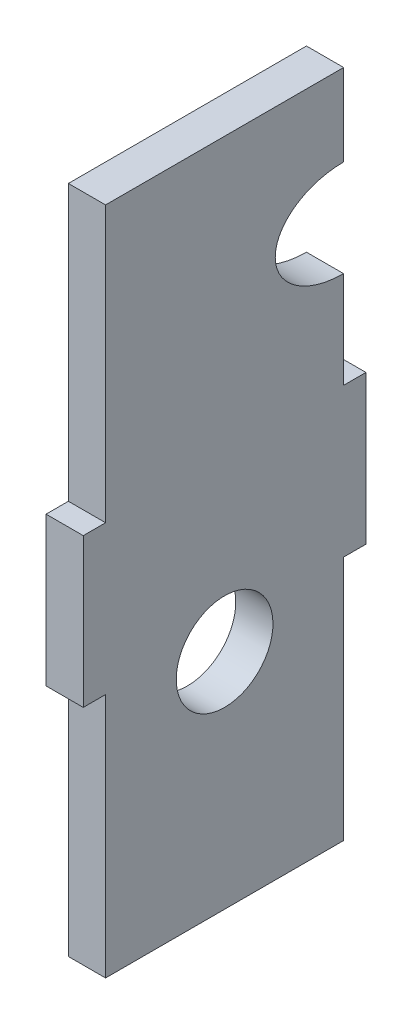
ISO-10303-21;
HEADER;
FILE_DESCRIPTION(('STEP AP214'),'2;1');
FILE_NAME('part.step','',(''),(''),'','','');
FILE_SCHEMA(('AUTOMOTIVE_DESIGN { 1 0 10303 214 1 1 1 1 }'));
ENDSEC;
DATA;
#1=APPLICATION_CONTEXT('core data for automotive mechanical design processes');
#2=APPLICATION_PROTOCOL_DEFINITION('international standard','automotive_design',2000,#1);
#3=PRODUCT_CONTEXT('',#1,'mechanical');
#4=PRODUCT('Part','Part','',(#3));
#5=PRODUCT_RELATED_PRODUCT_CATEGORY('part','',(#4));
#6=PRODUCT_DEFINITION_FORMATION('','',#4);
#7=PRODUCT_DEFINITION_CONTEXT('part definition',#1,'design');
#8=PRODUCT_DEFINITION('design','',#6,#7);
#9=PRODUCT_DEFINITION_SHAPE('','',#8);
#10=(LENGTH_UNIT() NAMED_UNIT(*) SI_UNIT(.MILLI.,.METRE.));
#11=(NAMED_UNIT(*) PLANE_ANGLE_UNIT() SI_UNIT($,.RADIAN.));
#12=(NAMED_UNIT(*) SI_UNIT($,.STERADIAN.) SOLID_ANGLE_UNIT());
#13=UNCERTAINTY_MEASURE_WITH_UNIT(LENGTH_MEASURE(1.E-05),#10,'distance_accuracy_value','');
#14=(GEOMETRIC_REPRESENTATION_CONTEXT(3) GLOBAL_UNCERTAINTY_ASSIGNED_CONTEXT((#13)) GLOBAL_UNIT_ASSIGNED_CONTEXT((#10,
#11,#12)) REPRESENTATION_CONTEXT('',''));
#15=CARTESIAN_POINT('',(0.,0.,0.));
#16=DIRECTION('',(0.,0.,1.));
#17=DIRECTION('',(1.,0.,0.));
#18=AXIS2_PLACEMENT_3D('',#15,#16,#17);
#19=CARTESIAN_POINT('',(36.,-32.5,3.99999999999999));
#20=DIRECTION('',(0.,0.,1.));
#21=DIRECTION('',(0.,1.,0.));
#22=AXIS2_PLACEMENT_3D('',#19,#20,#21);
#23=PLANE('',#22);
#24=DIRECTION('',(-1.,0.,0.));
#25=VECTOR('',#24,1.);
#26=CARTESIAN_POINT('',(36.,-19.5,4.));
#27=LINE('',#26,#25);
#28=CARTESIAN_POINT('',(41.,-19.5,4.));
#29=VERTEX_POINT('',#28);
#30=CARTESIAN_POINT('',(36.,-19.5,4.));
#31=VERTEX_POINT('',#30);
#32=EDGE_CURVE('E11',#29,#31,#27,.T.);
#33=ORIENTED_EDGE('',*,*,#32,.F.);
#34=DIRECTION('',(0.,-1.,0.));
#35=VECTOR('',#34,1.);
#36=CARTESIAN_POINT('',(41.,0.,3.99999999999999));
#37=LINE('',#36,#35);
#38=CARTESIAN_POINT('',(41.,-32.5,3.99999999999999));
#39=VERTEX_POINT('',#38);
#40=EDGE_CURVE('E129',#39,#29,#37,.F.);
#41=ORIENTED_EDGE('',*,*,#40,.F.);
#42=DIRECTION('',(-1.,0.,0.));
#43=VECTOR('',#42,1.);
#44=CARTESIAN_POINT('',(36.,-32.5,3.99999999999999));
#45=LINE('',#44,#43);
#46=CARTESIAN_POINT('',(36.,-32.5,3.99999999999999));
#47=VERTEX_POINT('',#46);
#48=EDGE_CURVE('E54',#39,#47,#45,.T.);
#49=ORIENTED_EDGE('',*,*,#48,.T.);
#50=DIRECTION('',(0.,1.,0.));
#51=VECTOR('',#50,1.);
#52=CARTESIAN_POINT('',(36.,-32.5,3.99999999999999));
#53=LINE('',#52,#51);
#54=EDGE_CURVE('E221',#47,#31,#53,.T.);
#55=ORIENTED_EDGE('',*,*,#54,.T.);
#56=EDGE_LOOP('',(#33,#41,#49,#55));
#57=FACE_BOUND('',#56,.T.);
#58=ADVANCED_FACE('F43',(#57),#23,.F.);
#59=CARTESIAN_POINT('',(36.,-32.5,0.99999999999999));
#60=DIRECTION('',(0.,-1.,0.));
#61=DIRECTION('',(0.,0.,1.));
#62=AXIS2_PLACEMENT_3D('',#59,#60,#61);
#63=PLANE('',#62);
#64=ORIENTED_EDGE('',*,*,#48,.F.);
#65=DIRECTION('',(0.,0.,1.));
#66=VECTOR('',#65,1.);
#67=CARTESIAN_POINT('',(41.,-32.5,0.));
#68=LINE('',#67,#66);
#69=CARTESIAN_POINT('',(41.,-32.5,0.99999999999999));
#70=VERTEX_POINT('',#69);
#71=EDGE_CURVE('E182',#70,#39,#68,.T.);
#72=ORIENTED_EDGE('',*,*,#71,.F.);
#73=DIRECTION('',(-1.,0.,0.));
#74=VECTOR('',#73,1.);
#75=CARTESIAN_POINT('',(36.,-32.5,0.99999999999999));
#76=LINE('',#75,#74);
#77=CARTESIAN_POINT('',(36.,-32.5,0.99999999999999));
#78=VERTEX_POINT('',#77);
#79=EDGE_CURVE('E214',#70,#78,#76,.T.);
#80=ORIENTED_EDGE('',*,*,#79,.T.);
#81=DIRECTION('',(0.,0.,1.));
#82=VECTOR('',#81,1.);
#83=CARTESIAN_POINT('',(36.,-32.5,0.99999999999999));
#84=LINE('',#83,#82);
#85=EDGE_CURVE('E231',#78,#47,#84,.T.);
#86=ORIENTED_EDGE('',*,*,#85,.T.);
#87=EDGE_LOOP('',(#64,#72,#80,#86));
#88=FACE_BOUND('',#87,.T.);
#89=ADVANCED_FACE('F236',(#88),#63,.F.);
#90=CARTESIAN_POINT('',(36.,-52.5,0.99999999999999));
#91=DIRECTION('',(0.,0.,1.));
#92=DIRECTION('',(0.,1.,0.));
#93=AXIS2_PLACEMENT_3D('',#90,#91,#92);
#94=PLANE('',#93);
#95=ORIENTED_EDGE('',*,*,#79,.F.);
#96=DIRECTION('',(0.,-1.,0.));
#97=VECTOR('',#96,1.);
#98=CARTESIAN_POINT('',(41.,0.,0.99999999999999));
#99=LINE('',#98,#97);
#100=CARTESIAN_POINT('',(41.,-52.5,0.99999999999999));
#101=VERTEX_POINT('',#100);
#102=EDGE_CURVE('E178',#101,#70,#99,.F.);
#103=ORIENTED_EDGE('',*,*,#102,.F.);
#104=DIRECTION('',(-1.,0.,0.));
#105=VECTOR('',#104,1.);
#106=CARTESIAN_POINT('',(36.,-52.5,0.99999999999999));
#107=LINE('',#106,#105);
#108=CARTESIAN_POINT('',(36.,-52.5,0.99999999999999));
#109=VERTEX_POINT('',#108);
#110=EDGE_CURVE('E211',#101,#109,#107,.T.);
#111=ORIENTED_EDGE('',*,*,#110,.T.);
#112=DIRECTION('',(0.,1.,0.));
#113=VECTOR('',#112,1.);
#114=CARTESIAN_POINT('',(36.,-52.5,0.99999999999999));
#115=LINE('',#114,#113);
#116=EDGE_CURVE('E238',#109,#78,#115,.T.);
#117=ORIENTED_EDGE('',*,*,#116,.T.);
#118=EDGE_LOOP('',(#95,#103,#111,#117));
#119=FACE_BOUND('',#118,.T.);
#120=ADVANCED_FACE('F307',(#119),#94,.F.);
#121=CARTESIAN_POINT('',(36.,-52.5,4.));
#122=DIRECTION('',(0.,1.,0.));
#123=DIRECTION('',(0.,0.,-1.));
#124=AXIS2_PLACEMENT_3D('',#121,#122,#123);
#125=PLANE('',#124);
#126=ORIENTED_EDGE('',*,*,#110,.F.);
#127=DIRECTION('',(0.,0.,1.));
#128=VECTOR('',#127,1.);
#129=CARTESIAN_POINT('',(41.,-52.5,0.));
#130=LINE('',#129,#128);
#131=CARTESIAN_POINT('',(41.,-52.5,4.));
#132=VERTEX_POINT('',#131);
#133=EDGE_CURVE('E174',#132,#101,#130,.F.);
#134=ORIENTED_EDGE('',*,*,#133,.F.);
#135=DIRECTION('',(-1.,0.,0.));
#136=VECTOR('',#135,1.);
#137=CARTESIAN_POINT('',(36.,-52.5,4.));
#138=LINE('',#137,#136);
#139=CARTESIAN_POINT('',(36.,-52.5,4.));
#140=VERTEX_POINT('',#139);
#141=EDGE_CURVE('E208',#132,#140,#138,.T.);
#142=ORIENTED_EDGE('',*,*,#141,.T.);
#143=DIRECTION('',(0.,0.,-1.));
#144=VECTOR('',#143,1.);
#145=CARTESIAN_POINT('',(36.,-52.5,4.));
#146=LINE('',#145,#144);
#147=EDGE_CURVE('E242',#140,#109,#146,.T.);
#148=ORIENTED_EDGE('',*,*,#147,.T.);
#149=EDGE_LOOP('',(#126,#134,#142,#148));
#150=FACE_BOUND('',#149,.T.);
#151=ADVANCED_FACE('F312',(#150),#125,.F.);
#152=CARTESIAN_POINT('',(36.,-85.5,4.));
#153=DIRECTION('',(0.,0.,1.));
#154=DIRECTION('',(0.,1.,0.));
#155=AXIS2_PLACEMENT_3D('',#152,#153,#154);
#156=PLANE('',#155);
#157=ORIENTED_EDGE('',*,*,#141,.F.);
#158=DIRECTION('',(0.,-1.,0.));
#159=VECTOR('',#158,1.);
#160=CARTESIAN_POINT('',(41.,0.,4.));
#161=LINE('',#160,#159);
#162=CARTESIAN_POINT('',(41.,-85.5,4.));
#163=VERTEX_POINT('',#162);
#164=EDGE_CURVE('E170',#163,#132,#161,.F.);
#165=ORIENTED_EDGE('',*,*,#164,.F.);
#166=DIRECTION('',(-1.,0.,0.));
#167=VECTOR('',#166,1.);
#168=CARTESIAN_POINT('',(36.,-85.5,4.));
#169=LINE('',#168,#167);
#170=CARTESIAN_POINT('',(36.,-85.5,4.));
#171=VERTEX_POINT('',#170);
#172=EDGE_CURVE('E205',#163,#171,#169,.T.);
#173=ORIENTED_EDGE('',*,*,#172,.T.);
#174=DIRECTION('',(0.,1.,0.));
#175=VECTOR('',#174,1.);
#176=CARTESIAN_POINT('',(36.,-85.5,4.));
#177=LINE('',#176,#175);
#178=EDGE_CURVE('E249',#171,#140,#177,.T.);
#179=ORIENTED_EDGE('',*,*,#178,.T.);
#180=EDGE_LOOP('',(#157,#165,#173,#179));
#181=FACE_BOUND('',#180,.T.);
#182=ADVANCED_FACE('F315',(#181),#156,.F.);
#183=CARTESIAN_POINT('',(36.,-85.5,36.));
#184=DIRECTION('',(0.,1.,0.));
#185=DIRECTION('',(0.,0.,-1.));
#186=AXIS2_PLACEMENT_3D('',#183,#184,#185);
#187=PLANE('',#186);
#188=ORIENTED_EDGE('',*,*,#172,.F.);
#189=DIRECTION('',(0.,0.,1.));
#190=VECTOR('',#189,1.);
#191=CARTESIAN_POINT('',(41.,-85.5,0.));
#192=LINE('',#191,#190);
#193=CARTESIAN_POINT('',(41.,-85.5,36.));
#194=VERTEX_POINT('',#193);
#195=EDGE_CURVE('E166',#194,#163,#192,.F.);
#196=ORIENTED_EDGE('',*,*,#195,.F.);
#197=DIRECTION('',(-1.,0.,0.));
#198=VECTOR('',#197,1.);
#199=CARTESIAN_POINT('',(36.,-85.5,36.));
#200=LINE('',#199,#198);
#201=CARTESIAN_POINT('',(36.,-85.5,36.));
#202=VERTEX_POINT('',#201);
#203=EDGE_CURVE('E202',#194,#202,#200,.T.);
#204=ORIENTED_EDGE('',*,*,#203,.T.);
#205=DIRECTION('',(0.,0.,-1.));
#206=VECTOR('',#205,1.);
#207=CARTESIAN_POINT('',(36.,-85.5,36.));
#208=LINE('',#207,#206);
#209=EDGE_CURVE('E253',#202,#171,#208,.T.);
#210=ORIENTED_EDGE('',*,*,#209,.T.);
#211=EDGE_LOOP('',(#188,#196,#204,#210));
#212=FACE_BOUND('',#211,.T.);
#213=ADVANCED_FACE('F319',(#212),#187,.F.);
#214=CARTESIAN_POINT('',(36.,-52.5,36.));
#215=DIRECTION('',(0.,0.,-1.));
#216=DIRECTION('',(0.,-1.,0.));
#217=AXIS2_PLACEMENT_3D('',#214,#215,#216);
#218=PLANE('',#217);
#219=ORIENTED_EDGE('',*,*,#203,.F.);
#220=DIRECTION('',(0.,-1.,0.));
#221=VECTOR('',#220,1.);
#222=CARTESIAN_POINT('',(41.,0.,36.));
#223=LINE('',#222,#221);
#224=CARTESIAN_POINT('',(41.,-52.5,36.));
#225=VERTEX_POINT('',#224);
#226=EDGE_CURVE('E162',#225,#194,#223,.T.);
#227=ORIENTED_EDGE('',*,*,#226,.F.);
#228=DIRECTION('',(-1.,0.,0.));
#229=VECTOR('',#228,1.);
#230=CARTESIAN_POINT('',(36.,-52.5,36.));
#231=LINE('',#230,#229);
#232=CARTESIAN_POINT('',(36.,-52.5,36.));
#233=VERTEX_POINT('',#232);
#234=EDGE_CURVE('E199',#225,#233,#231,.T.);
#235=ORIENTED_EDGE('',*,*,#234,.T.);
#236=DIRECTION('',(0.,-1.,0.));
#237=VECTOR('',#236,1.);
#238=CARTESIAN_POINT('',(36.,-52.5,36.));
#239=LINE('',#238,#237);
#240=EDGE_CURVE('E257',#233,#202,#239,.T.);
#241=ORIENTED_EDGE('',*,*,#240,.T.);
#242=EDGE_LOOP('',(#219,#227,#235,#241));
#243=FACE_BOUND('',#242,.T.);
#244=ADVANCED_FACE('F324',(#243),#218,.F.);
#245=CARTESIAN_POINT('',(36.,-52.5,39.));
#246=DIRECTION('',(0.,1.,0.));
#247=DIRECTION('',(0.,0.,-1.));
#248=AXIS2_PLACEMENT_3D('',#245,#246,#247);
#249=PLANE('',#248);
#250=ORIENTED_EDGE('',*,*,#234,.F.);
#251=DIRECTION('',(0.,0.,1.));
#252=VECTOR('',#251,1.);
#253=CARTESIAN_POINT('',(41.,-52.5,0.));
#254=LINE('',#253,#252);
#255=CARTESIAN_POINT('',(41.,-52.5,39.));
#256=VERTEX_POINT('',#255);
#257=EDGE_CURVE('E158',#256,#225,#254,.F.);
#258=ORIENTED_EDGE('',*,*,#257,.F.);
#259=DIRECTION('',(-1.,0.,0.));
#260=VECTOR('',#259,1.);
#261=CARTESIAN_POINT('',(36.,-52.5,39.));
#262=LINE('',#261,#260);
#263=CARTESIAN_POINT('',(36.,-52.5,39.));
#264=VERTEX_POINT('',#263);
#265=EDGE_CURVE('E196',#256,#264,#262,.T.);
#266=ORIENTED_EDGE('',*,*,#265,.T.);
#267=DIRECTION('',(0.,0.,-1.));
#268=VECTOR('',#267,1.);
#269=CARTESIAN_POINT('',(36.,-52.5,39.));
#270=LINE('',#269,#268);
#271=EDGE_CURVE('E261',#264,#233,#270,.T.);
#272=ORIENTED_EDGE('',*,*,#271,.T.);
#273=EDGE_LOOP('',(#250,#258,#266,#272));
#274=FACE_BOUND('',#273,.T.);
#275=ADVANCED_FACE('F327',(#274),#249,.F.);
#276=CARTESIAN_POINT('',(36.,-32.5,39.));
#277=DIRECTION('',(0.,0.,-1.));
#278=DIRECTION('',(0.,-1.,0.));
#279=AXIS2_PLACEMENT_3D('',#276,#277,#278);
#280=PLANE('',#279);
#281=ORIENTED_EDGE('',*,*,#265,.F.);
#282=DIRECTION('',(0.,-1.,0.));
#283=VECTOR('',#282,1.);
#284=CARTESIAN_POINT('',(41.,0.,39.));
#285=LINE('',#284,#283);
#286=CARTESIAN_POINT('',(41.,-32.5,39.));
#287=VERTEX_POINT('',#286);
#288=EDGE_CURVE('E154',#287,#256,#285,.T.);
#289=ORIENTED_EDGE('',*,*,#288,.F.);
#290=DIRECTION('',(-1.,0.,0.));
#291=VECTOR('',#290,1.);
#292=CARTESIAN_POINT('',(36.,-32.5,39.));
#293=LINE('',#292,#291);
#294=CARTESIAN_POINT('',(36.,-32.5,39.));
#295=VERTEX_POINT('',#294);
#296=EDGE_CURVE('E193',#287,#295,#293,.T.);
#297=ORIENTED_EDGE('',*,*,#296,.T.);
#298=DIRECTION('',(0.,-1.,0.));
#299=VECTOR('',#298,1.);
#300=CARTESIAN_POINT('',(36.,-32.5,39.));
#301=LINE('',#300,#299);
#302=EDGE_CURVE('E265',#295,#264,#301,.T.);
#303=ORIENTED_EDGE('',*,*,#302,.T.);
#304=EDGE_LOOP('',(#281,#289,#297,#303));
#305=FACE_BOUND('',#304,.T.);
#306=ADVANCED_FACE('F330',(#305),#280,.F.);
#307=CARTESIAN_POINT('',(36.,-32.5,36.));
#308=DIRECTION('',(0.,-1.,0.));
#309=DIRECTION('',(0.,0.,1.));
#310=AXIS2_PLACEMENT_3D('',#307,#308,#309);
#311=PLANE('',#310);
#312=ORIENTED_EDGE('',*,*,#296,.F.);
#313=DIRECTION('',(0.,0.,1.));
#314=VECTOR('',#313,1.);
#315=CARTESIAN_POINT('',(41.,-32.5,0.));
#316=LINE('',#315,#314);
#317=CARTESIAN_POINT('',(41.,-32.5,36.));
#318=VERTEX_POINT('',#317);
#319=EDGE_CURVE('E150',#318,#287,#316,.T.);
#320=ORIENTED_EDGE('',*,*,#319,.F.);
#321=DIRECTION('',(-1.,0.,0.));
#322=VECTOR('',#321,1.);
#323=CARTESIAN_POINT('',(36.,-32.5,36.));
#324=LINE('',#323,#322);
#325=CARTESIAN_POINT('',(36.,-32.5,36.));
#326=VERTEX_POINT('',#325);
#327=EDGE_CURVE('E190',#318,#326,#324,.T.);
#328=ORIENTED_EDGE('',*,*,#327,.T.);
#329=DIRECTION('',(0.,0.,1.));
#330=VECTOR('',#329,1.);
#331=CARTESIAN_POINT('',(36.,-32.5,36.));
#332=LINE('',#331,#330);
#333=EDGE_CURVE('E269',#326,#295,#332,.T.);
#334=ORIENTED_EDGE('',*,*,#333,.T.);
#335=EDGE_LOOP('',(#312,#320,#328,#334));
#336=FACE_BOUND('',#335,.T.);
#337=ADVANCED_FACE('F331',(#336),#311,.F.);
#338=CARTESIAN_POINT('',(36.,4.49999999999999,36.));
#339=DIRECTION('',(0.,0.,-1.));
#340=DIRECTION('',(0.,-1.,0.));
#341=AXIS2_PLACEMENT_3D('',#338,#339,#340);
#342=PLANE('',#341);
#343=ORIENTED_EDGE('',*,*,#327,.F.);
#344=DIRECTION('',(0.,-1.,0.));
#345=VECTOR('',#344,1.);
#346=CARTESIAN_POINT('',(41.,0.,36.));
#347=LINE('',#346,#345);
#348=CARTESIAN_POINT('',(41.,4.49999999999999,36.));
#349=VERTEX_POINT('',#348);
#350=EDGE_CURVE('E146',#349,#318,#347,.T.);
#351=ORIENTED_EDGE('',*,*,#350,.F.);
#352=DIRECTION('',(-1.,0.,0.));
#353=VECTOR('',#352,1.);
#354=CARTESIAN_POINT('',(36.,4.49999999999999,36.));
#355=LINE('',#354,#353);
#356=CARTESIAN_POINT('',(36.,4.49999999999999,36.));
#357=VERTEX_POINT('',#356);
#358=EDGE_CURVE('E188',#349,#357,#355,.T.);
#359=ORIENTED_EDGE('',*,*,#358,.T.);
#360=DIRECTION('',(0.,-1.,0.));
#361=VECTOR('',#360,1.);
#362=CARTESIAN_POINT('',(36.,4.49999999999999,36.));
#363=LINE('',#362,#361);
#364=EDGE_CURVE('E273',#357,#326,#363,.T.);
#365=ORIENTED_EDGE('',*,*,#364,.T.);
#366=EDGE_LOOP('',(#343,#351,#359,#365));
#367=FACE_BOUND('',#366,.T.);
#368=ADVANCED_FACE('F285',(#367),#342,.F.);
#369=CARTESIAN_POINT('',(36.,4.49999999999999,36.));
#370=DIRECTION('',(0.,-1.,0.));
#371=DIRECTION('',(0.,0.,1.));
#372=AXIS2_PLACEMENT_3D('',#369,#370,#371);
#373=PLANE('',#372);
#374=ORIENTED_EDGE('',*,*,#358,.F.);
#375=DIRECTION('',(0.,0.,1.));
#376=VECTOR('',#375,1.);
#377=CARTESIAN_POINT('',(41.,4.5,0.));
#378=LINE('',#377,#376);
#379=CARTESIAN_POINT('',(41.,4.5,4.));
#380=VERTEX_POINT('',#379);
#381=EDGE_CURVE('E142',#380,#349,#378,.T.);
#382=ORIENTED_EDGE('',*,*,#381,.F.);
#383=DIRECTION('',(-1.,0.,0.));
#384=VECTOR('',#383,1.);
#385=CARTESIAN_POINT('',(36.,4.5,4.));
#386=LINE('',#385,#384);
#387=CARTESIAN_POINT('',(36.,4.5,4.));
#388=VERTEX_POINT('',#387);
#389=EDGE_CURVE('E62',#380,#388,#386,.T.);
#390=ORIENTED_EDGE('',*,*,#389,.T.);
#391=DIRECTION('',(0.,0.,1.));
#392=VECTOR('',#391,1.);
#393=CARTESIAN_POINT('',(36.,4.49999999999999,36.));
#394=LINE('',#393,#392);
#395=EDGE_CURVE('E122',#388,#357,#394,.T.);
#396=ORIENTED_EDGE('',*,*,#395,.T.);
#397=EDGE_LOOP('',(#374,#382,#390,#396));
#398=FACE_BOUND('',#397,.T.);
#399=ADVANCED_FACE('F279',(#398),#373,.F.);
#400=ORIENTED_EDGE('',*,*,#389,.F.);
#401=DIRECTION('',(0.,-1.,0.));
#402=VECTOR('',#401,1.);
#403=CARTESIAN_POINT('',(41.,0.,4.));
#404=LINE('',#403,#402);
#405=CARTESIAN_POINT('',(41.,-6.49999999999999,4.));
#406=VERTEX_POINT('',#405);
#407=EDGE_CURVE('E127',#406,#380,#404,.F.);
#408=ORIENTED_EDGE('',*,*,#407,.F.);
#409=DIRECTION('',(-1.,0.,0.));
#410=VECTOR('',#409,1.);
#411=CARTESIAN_POINT('',(36.,-6.49999999999999,4.));
#412=LINE('',#411,#410);
#413=CARTESIAN_POINT('',(36.,-6.49999999999999,4.));
#414=VERTEX_POINT('',#413);
#415=EDGE_CURVE('E48',#406,#414,#412,.T.);
#416=ORIENTED_EDGE('',*,*,#415,.T.);
#417=EDGE_CURVE('E235',#414,#388,#53,.T.);
#418=ORIENTED_EDGE('',*,*,#417,.T.);
#419=EDGE_LOOP('',(#400,#408,#416,#418));
#420=FACE_BOUND('',#419,.T.);
#421=ADVANCED_FACE('F132',(#420),#23,.F.);
#422=CARTESIAN_POINT('',(36.,-55.5,20.));
#423=DIRECTION('',(-1.,0.,0.));
#424=DIRECTION('',(0.,-1.,0.));
#425=AXIS2_PLACEMENT_3D('',#422,#423,#424);
#426=CYLINDRICAL_SURFACE('',#425,6.5);
#427=CARTESIAN_POINT('',(36.,-55.5,20.));
#428=DIRECTION('',(-1.,0.,0.));
#429=DIRECTION('',(0.,-1.,0.));
#430=AXIS2_PLACEMENT_3D('',#427,#428,#429);
#431=CIRCLE('',#430,6.5);
#432=CARTESIAN_POINT('',(36.,-62.,20.));
#433=VERTEX_POINT('',#432);
#434=EDGE_CURVE('E145',#433,#433,#431,.F.);
#435=ORIENTED_EDGE('',*,*,#434,.F.);
#436=EDGE_LOOP('',(#435));
#437=FACE_BOUND('',#436,.T.);
#438=CARTESIAN_POINT('',(41.,-55.5,20.));
#439=DIRECTION('',(-1.,0.,0.));
#440=DIRECTION('',(0.,-1.,0.));
#441=AXIS2_PLACEMENT_3D('',#438,#439,#440);
#442=CIRCLE('',#441,6.5);
#443=CARTESIAN_POINT('',(41.,-62.,20.));
#444=VERTEX_POINT('',#443);
#445=EDGE_CURVE('E134',#444,#444,#442,.F.);
#446=ORIENTED_EDGE('',*,*,#445,.T.);
#447=EDGE_LOOP('',(#446));
#448=FACE_BOUND('',#447,.T.);
#449=ADVANCED_FACE('F348',(#437,#448),#426,.F.);
#450=CARTESIAN_POINT('',(36.,-13.,4.));
#451=DIRECTION('',(-1.,0.,0.));
#452=DIRECTION('',(0.,0.,-1.));
#453=AXIS2_PLACEMENT_3D('',#450,#451,#452);
#454=ELLIPSE('',#453,9.19238815542512,6.5);
#455=DIRECTION('',(-1.,0.,0.));
#456=VECTOR('',#455,1.);
#457=SURFACE_OF_LINEAR_EXTRUSION('',#454,#456);
#458=CARTESIAN_POINT('',(41.,-13.,4.));
#459=DIRECTION('',(-1.,0.,0.));
#460=DIRECTION('',(0.,0.,-1.));
#461=AXIS2_PLACEMENT_3D('',#458,#459,#460);
#462=ELLIPSE('',#461,9.19238815542512,6.5);
#463=EDGE_CURVE('E116',#29,#406,#462,.T.);
#464=ORIENTED_EDGE('',*,*,#463,.F.);
#465=ORIENTED_EDGE('',*,*,#32,.T.);
#466=EDGE_CURVE('E118',#31,#414,#454,.T.);
#467=ORIENTED_EDGE('',*,*,#466,.T.);
#468=ORIENTED_EDGE('',*,*,#415,.F.);
#469=EDGE_LOOP('',(#464,#465,#467,#468));
#470=FACE_BOUND('',#469,.T.);
#471=ADVANCED_FACE('F45',(#470),#457,.F.);
#472=CARTESIAN_POINT('',(36.,0.,0.));
#473=DIRECTION('',(-1.,0.,0.));
#474=DIRECTION('',(0.,-1.,0.));
#475=AXIS2_PLACEMENT_3D('',#472,#473,#474);
#476=PLANE('',#475);
#477=ORIENTED_EDGE('',*,*,#434,.T.);
#478=EDGE_LOOP('',(#477));
#479=FACE_BOUND('',#478,.T.);
#480=ORIENTED_EDGE('',*,*,#417,.F.);
#481=ORIENTED_EDGE('',*,*,#466,.F.);
#482=ORIENTED_EDGE('',*,*,#54,.F.);
#483=ORIENTED_EDGE('',*,*,#85,.F.);
#484=ORIENTED_EDGE('',*,*,#116,.F.);
#485=ORIENTED_EDGE('',*,*,#147,.F.);
#486=ORIENTED_EDGE('',*,*,#178,.F.);
#487=ORIENTED_EDGE('',*,*,#209,.F.);
#488=ORIENTED_EDGE('',*,*,#240,.F.);
#489=ORIENTED_EDGE('',*,*,#271,.F.);
#490=ORIENTED_EDGE('',*,*,#302,.F.);
#491=ORIENTED_EDGE('',*,*,#333,.F.);
#492=ORIENTED_EDGE('',*,*,#364,.F.);
#493=ORIENTED_EDGE('',*,*,#395,.F.);
#494=EDGE_LOOP('',(#480,#481,#482,#483,#484,#485,#486,#487,#488,#489,#490,#491,#492,#493));
#495=FACE_BOUND('',#494,.T.);
#496=ADVANCED_FACE('F229',(#479,#495),#476,.T.);
#497=CARTESIAN_POINT('',(41.,0.,0.));
#498=DIRECTION('',(-1.,0.,0.));
#499=DIRECTION('',(0.,-1.,0.));
#500=AXIS2_PLACEMENT_3D('',#497,#498,#499);
#501=PLANE('',#500);
#502=ORIENTED_EDGE('',*,*,#445,.F.);
#503=EDGE_LOOP('',(#502));
#504=FACE_BOUND('',#503,.T.);
#505=ORIENTED_EDGE('',*,*,#407,.T.);
#506=ORIENTED_EDGE('',*,*,#381,.T.);
#507=ORIENTED_EDGE('',*,*,#350,.T.);
#508=ORIENTED_EDGE('',*,*,#319,.T.);
#509=ORIENTED_EDGE('',*,*,#288,.T.);
#510=ORIENTED_EDGE('',*,*,#257,.T.);
#511=ORIENTED_EDGE('',*,*,#226,.T.);
#512=ORIENTED_EDGE('',*,*,#195,.T.);
#513=ORIENTED_EDGE('',*,*,#164,.T.);
#514=ORIENTED_EDGE('',*,*,#133,.T.);
#515=ORIENTED_EDGE('',*,*,#102,.T.);
#516=ORIENTED_EDGE('',*,*,#71,.T.);
#517=ORIENTED_EDGE('',*,*,#40,.T.);
#518=ORIENTED_EDGE('',*,*,#463,.T.);
#519=EDGE_LOOP('',(#505,#506,#507,#508,#509,#510,#511,#512,#513,#514,#515,#516,#517,#518));
#520=FACE_BOUND('',#519,.T.);
#521=ADVANCED_FACE('F125',(#504,#520),#501,.F.);
#522=CLOSED_SHELL('',(#58,#89,#120,#151,#182,#213,#244,#275,#306,#337,#368,#399,#421,#449,#471,
#496,#521));
#523=MANIFOLD_SOLID_BREP('B2',#522);
#524=ADVANCED_BREP_SHAPE_REPRESENTATION('',(#18,#523),#14);
#525=SHAPE_DEFINITION_REPRESENTATION(#9,#524);
ENDSEC;
END-ISO-10303-21;
